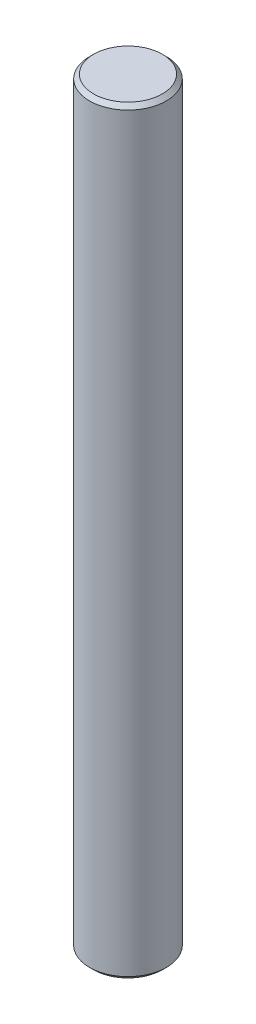
ISO-10303-21;
HEADER;
FILE_DESCRIPTION(('STEP AP214'),'2;1');
FILE_NAME('part.step','',(''),(''),'','','');
FILE_SCHEMA(('AUTOMOTIVE_DESIGN { 1 0 10303 214 1 1 1 1 }'));
ENDSEC;
DATA;
#1=APPLICATION_CONTEXT('core data for automotive mechanical design processes');
#2=APPLICATION_PROTOCOL_DEFINITION('international standard','automotive_design',2000,#1);
#3=PRODUCT_CONTEXT('',#1,'mechanical');
#4=PRODUCT('Part','Part','',(#3));
#5=PRODUCT_RELATED_PRODUCT_CATEGORY('part','',(#4));
#6=PRODUCT_DEFINITION_FORMATION('','',#4);
#7=PRODUCT_DEFINITION_CONTEXT('part definition',#1,'design');
#8=PRODUCT_DEFINITION('design','',#6,#7);
#9=PRODUCT_DEFINITION_SHAPE('','',#8);
#10=(LENGTH_UNIT() NAMED_UNIT(*) SI_UNIT(.MILLI.,.METRE.));
#11=(NAMED_UNIT(*) PLANE_ANGLE_UNIT() SI_UNIT($,.RADIAN.));
#12=(NAMED_UNIT(*) SI_UNIT($,.STERADIAN.) SOLID_ANGLE_UNIT());
#13=UNCERTAINTY_MEASURE_WITH_UNIT(LENGTH_MEASURE(1.E-05),#10,'distance_accuracy_value','');
#14=(GEOMETRIC_REPRESENTATION_CONTEXT(3) GLOBAL_UNCERTAINTY_ASSIGNED_CONTEXT((#13)) GLOBAL_UNIT_ASSIGNED_CONTEXT((#10,
#11,#12)) REPRESENTATION_CONTEXT('',''));
#15=CARTESIAN_POINT('',(0.,0.,0.));
#16=DIRECTION('',(0.,0.,1.));
#17=DIRECTION('',(1.,0.,0.));
#18=AXIS2_PLACEMENT_3D('',#15,#16,#17);
#19=CARTESIAN_POINT('',(0.,47.625,0.));
#20=DIRECTION('',(0.,-1.,0.));
#21=DIRECTION('',(0.,0.,-1.));
#22=AXIS2_PLACEMENT_3D('',#19,#20,#21);
#23=CYLINDRICAL_SURFACE('',#22,4.826);
#24=CARTESIAN_POINT('',(0.,-47.117,0.));
#25=DIRECTION('',(0.,1.,0.));
#26=DIRECTION('',(0.,0.,1.));
#27=AXIS2_PLACEMENT_3D('',#24,#25,#26);
#28=CIRCLE('',#27,4.826);
#29=CARTESIAN_POINT('',(0.,-47.117,4.826));
#30=VERTEX_POINT('',#29);
#31=EDGE_CURVE('E53',#30,#30,#28,.T.);
#32=ORIENTED_EDGE('',*,*,#31,.T.);
#33=EDGE_LOOP('',(#32));
#34=FACE_BOUND('',#33,.T.);
#35=CARTESIAN_POINT('',(0.,47.117,0.));
#36=DIRECTION('',(0.,1.,0.));
#37=DIRECTION('',(0.,0.,1.));
#38=AXIS2_PLACEMENT_3D('',#35,#36,#37);
#39=CIRCLE('',#38,4.826);
#40=CARTESIAN_POINT('',(0.,47.117,4.826));
#41=VERTEX_POINT('',#40);
#42=EDGE_CURVE('E58',#41,#41,#39,.F.);
#43=ORIENTED_EDGE('',*,*,#42,.T.);
#44=EDGE_LOOP('',(#43));
#45=FACE_BOUND('',#44,.T.);
#46=ADVANCED_FACE('F39',(#34,#45),#23,.T.);
#47=CARTESIAN_POINT('',(0.,47.625,0.));
#48=DIRECTION('',(0.,1.,0.));
#49=DIRECTION('',(0.,0.,1.));
#50=AXIS2_PLACEMENT_3D('',#47,#48,#49);
#51=PLANE('',#50);
#52=CARTESIAN_POINT('',(0.,47.625,0.));
#53=DIRECTION('',(0.,1.,0.));
#54=DIRECTION('',(0.,0.,1.));
#55=AXIS2_PLACEMENT_3D('',#52,#53,#54);
#56=CIRCLE('',#55,4.31800000000002);
#57=CARTESIAN_POINT('',(0.,47.625,4.31800000000002));
#58=VERTEX_POINT('',#57);
#59=EDGE_CURVE('E10',#58,#58,#56,.T.);
#60=ORIENTED_EDGE('',*,*,#59,.T.);
#61=EDGE_LOOP('',(#60));
#62=FACE_BOUND('',#61,.T.);
#63=ADVANCED_FACE('F75',(#62),#51,.T.);
#64=CARTESIAN_POINT('',(0.,-47.625,0.));
#65=DIRECTION('',(0.,1.,0.));
#66=DIRECTION('',(0.,0.,1.));
#67=AXIS2_PLACEMENT_3D('',#64,#65,#66);
#68=PLANE('',#67);
#69=CARTESIAN_POINT('',(0.,-47.625,0.));
#70=DIRECTION('',(0.,1.,0.));
#71=DIRECTION('',(0.,0.,1.));
#72=AXIS2_PLACEMENT_3D('',#69,#70,#71);
#73=CIRCLE('',#72,4.31799999999999);
#74=CARTESIAN_POINT('',(0.,-47.625,4.31799999999999));
#75=VERTEX_POINT('',#74);
#76=EDGE_CURVE('E48',#75,#75,#73,.F.);
#77=ORIENTED_EDGE('',*,*,#76,.T.);
#78=EDGE_LOOP('',(#77));
#79=FACE_BOUND('',#78,.T.);
#80=ADVANCED_FACE('F72',(#79),#68,.F.);
#81=CARTESIAN_POINT('',(0.,-47.117,0.));
#82=DIRECTION('',(0.,1.,0.));
#83=DIRECTION('',(0.,0.,1.));
#84=AXIS2_PLACEMENT_3D('',#81,#82,#83);
#85=CONICAL_SURFACE('',#84,4.826,0.785398163397451);
#86=ORIENTED_EDGE('',*,*,#76,.F.);
#87=EDGE_LOOP('',(#86));
#88=FACE_BOUND('',#87,.T.);
#89=ORIENTED_EDGE('',*,*,#31,.F.);
#90=EDGE_LOOP('',(#89));
#91=FACE_BOUND('',#90,.T.);
#92=ADVANCED_FACE('F68',(#88,#91),#85,.T.);
#93=CARTESIAN_POINT('',(0.,47.625,0.));
#94=DIRECTION('',(0.,-1.,0.));
#95=DIRECTION('',(0.,0.,-1.));
#96=AXIS2_PLACEMENT_3D('',#93,#94,#95);
#97=CONICAL_SURFACE('',#96,4.31800000000002,0.785398163397444);
#98=ORIENTED_EDGE('',*,*,#42,.F.);
#99=EDGE_LOOP('',(#98));
#100=FACE_BOUND('',#99,.T.);
#101=ORIENTED_EDGE('',*,*,#59,.F.);
#102=EDGE_LOOP('',(#101));
#103=FACE_BOUND('',#102,.T.);
#104=ADVANCED_FACE('F42',(#100,#103),#97,.T.);
#105=CLOSED_SHELL('',(#46,#63,#80,#92,#104));
#106=MANIFOLD_SOLID_BREP('B2',#105);
#107=ADVANCED_BREP_SHAPE_REPRESENTATION('',(#18,#106),#14);
#108=SHAPE_DEFINITION_REPRESENTATION(#9,#107);
ENDSEC;
END-ISO-10303-21;
